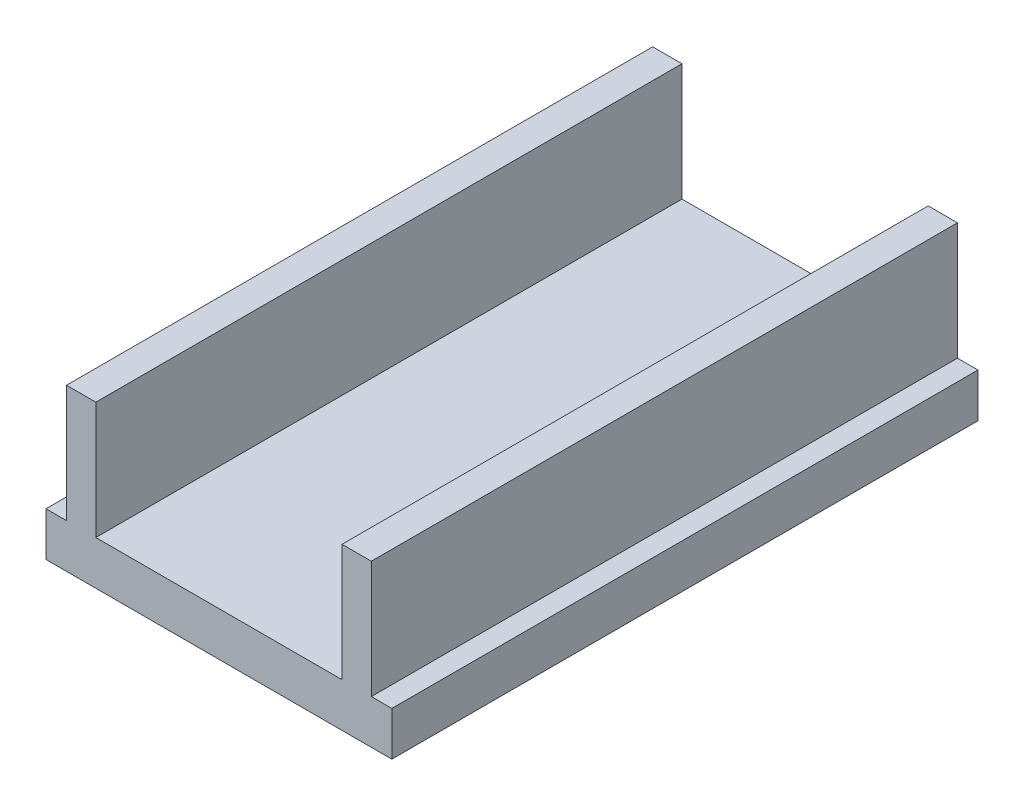
ISO-10303-21;
HEADER;
FILE_DESCRIPTION(('STEP AP214'),'2;1');
FILE_NAME('part.step','',(''),(''),'','','');
FILE_SCHEMA(('AUTOMOTIVE_DESIGN { 1 0 10303 214 1 1 1 1 }'));
ENDSEC;
DATA;
#1=APPLICATION_CONTEXT('core data for automotive mechanical design processes');
#2=APPLICATION_PROTOCOL_DEFINITION('international standard','automotive_design',2000,#1);
#3=PRODUCT_CONTEXT('',#1,'mechanical');
#4=PRODUCT('Part','Part','',(#3));
#5=PRODUCT_RELATED_PRODUCT_CATEGORY('part','',(#4));
#6=PRODUCT_DEFINITION_FORMATION('','',#4);
#7=PRODUCT_DEFINITION_CONTEXT('part definition',#1,'design');
#8=PRODUCT_DEFINITION('design','',#6,#7);
#9=PRODUCT_DEFINITION_SHAPE('','',#8);
#10=(LENGTH_UNIT() NAMED_UNIT(*) SI_UNIT(.MILLI.,.METRE.));
#11=(NAMED_UNIT(*) PLANE_ANGLE_UNIT() SI_UNIT($,.RADIAN.));
#12=(NAMED_UNIT(*) SI_UNIT($,.STERADIAN.) SOLID_ANGLE_UNIT());
#13=UNCERTAINTY_MEASURE_WITH_UNIT(LENGTH_MEASURE(1.E-05),#10,'distance_accuracy_value','');
#14=(GEOMETRIC_REPRESENTATION_CONTEXT(3) GLOBAL_UNCERTAINTY_ASSIGNED_CONTEXT((#13)) GLOBAL_UNIT_ASSIGNED_CONTEXT((#10,
#11,#12)) REPRESENTATION_CONTEXT('',''));
#15=CARTESIAN_POINT('',(0.,0.,0.));
#16=DIRECTION('',(0.,0.,1.));
#17=DIRECTION('',(1.,0.,0.));
#18=AXIS2_PLACEMENT_3D('',#15,#16,#17);
#19=CARTESIAN_POINT('',(0.,1.5,0.));
#20=DIRECTION('',(0.,1.,0.));
#21=DIRECTION('',(0.,0.,1.));
#22=AXIS2_PLACEMENT_3D('',#19,#20,#21);
#23=PLANE('',#22);
#24=DIRECTION('',(0.,0.,-1.));
#25=VECTOR('',#24,1.);
#26=CARTESIAN_POINT('',(3.81812080536913,1.5,0.));
#27=LINE('',#26,#25);
#28=CARTESIAN_POINT('',(3.81812080536913,1.5,7.15436241610738));
#29=VERTEX_POINT('',#28);
#30=CARTESIAN_POINT('',(3.81812080536913,1.5,-12.8456375838926));
#31=VERTEX_POINT('',#30);
#32=EDGE_CURVE('E163',#29,#31,#27,.T.);
#33=ORIENTED_EDGE('',*,*,#32,.T.);
#34=DIRECTION('',(1.,0.,0.));
#35=VECTOR('',#34,1.);
#36=CARTESIAN_POINT('',(0.,1.5,-12.8456375838926));
#37=LINE('',#36,#35);
#38=CARTESIAN_POINT('',(-4.58187919463087,1.5,-12.8456375838926));
#39=VERTEX_POINT('',#38);
#40=EDGE_CURVE('E150',#39,#31,#37,.T.);
#41=ORIENTED_EDGE('',*,*,#40,.F.);
#42=DIRECTION('',(0.,0.,-1.));
#43=VECTOR('',#42,1.);
#44=CARTESIAN_POINT('',(-4.58187919463087,1.5,0.));
#45=LINE('',#44,#43);
#46=CARTESIAN_POINT('',(-4.58187919463087,1.5,7.15436241610738));
#47=VERTEX_POINT('',#46);
#48=EDGE_CURVE('E184',#47,#39,#45,.T.);
#49=ORIENTED_EDGE('',*,*,#48,.F.);
#50=DIRECTION('',(1.,0.,0.));
#51=VECTOR('',#50,1.);
#52=CARTESIAN_POINT('',(0.,1.5,7.15436241610738));
#53=LINE('',#52,#51);
#54=EDGE_CURVE('E225',#47,#29,#53,.T.);
#55=ORIENTED_EDGE('',*,*,#54,.T.);
#56=EDGE_LOOP('',(#33,#41,#49,#55));
#57=FACE_BOUND('',#56,.T.);
#58=ADVANCED_FACE('F41',(#57),#23,.T.);
#59=CARTESIAN_POINT('',(-6.28187919463087,1.5,7.15436241610738));
#60=VERTEX_POINT('',#59);
#61=CARTESIAN_POINT('',(-5.58187919463087,1.5,7.15436241610738));
#62=VERTEX_POINT('',#61);
#63=EDGE_CURVE('E221',#60,#62,#53,.T.);
#64=ORIENTED_EDGE('',*,*,#63,.T.);
#65=DIRECTION('',(0.,0.,-1.));
#66=VECTOR('',#65,1.);
#67=CARTESIAN_POINT('',(-5.58187919463087,1.5,0.));
#68=LINE('',#67,#66);
#69=CARTESIAN_POINT('',(-5.58187919463087,1.5,-12.8456375838926));
#70=VERTEX_POINT('',#69);
#71=EDGE_CURVE('E65',#62,#70,#68,.T.);
#72=ORIENTED_EDGE('',*,*,#71,.T.);
#73=CARTESIAN_POINT('',(-6.28187919463087,1.5,-12.8456375838926));
#74=VERTEX_POINT('',#73);
#75=EDGE_CURVE('E230',#74,#70,#37,.T.);
#76=ORIENTED_EDGE('',*,*,#75,.F.);
#77=DIRECTION('',(0.,0.,1.));
#78=VECTOR('',#77,1.);
#79=CARTESIAN_POINT('',(-6.28187919463087,1.5,0.));
#80=LINE('',#79,#78);
#81=EDGE_CURVE('E215',#74,#60,#80,.T.);
#82=ORIENTED_EDGE('',*,*,#81,.T.);
#83=EDGE_LOOP('',(#64,#72,#76,#82));
#84=FACE_BOUND('',#83,.T.);
#85=ADVANCED_FACE('F287',(#84),#23,.T.);
#86=CARTESIAN_POINT('',(-6.28187919463087,1.5,0.));
#87=DIRECTION('',(1.,0.,0.));
#88=DIRECTION('',(0.,0.,-1.));
#89=AXIS2_PLACEMENT_3D('',#86,#87,#88);
#90=PLANE('',#89);
#91=DIRECTION('',(0.,0.,1.));
#92=VECTOR('',#91,1.);
#93=CARTESIAN_POINT('',(-6.28187919463087,0.,0.));
#94=LINE('',#93,#92);
#95=CARTESIAN_POINT('',(-6.28187919463087,0.,-12.8456375838926));
#96=VERTEX_POINT('',#95);
#97=CARTESIAN_POINT('',(-6.28187919463087,0.,7.15436241610738));
#98=VERTEX_POINT('',#97);
#99=EDGE_CURVE('E204',#96,#98,#94,.T.);
#100=ORIENTED_EDGE('',*,*,#99,.T.);
#101=DIRECTION('',(0.,-1.,0.));
#102=VECTOR('',#101,1.);
#103=CARTESIAN_POINT('',(-6.28187919463087,1.5,7.15436241610738));
#104=LINE('',#103,#102);
#105=EDGE_CURVE('E11',#60,#98,#104,.T.);
#106=ORIENTED_EDGE('',*,*,#105,.F.);
#107=ORIENTED_EDGE('',*,*,#81,.F.);
#108=DIRECTION('',(0.,-1.,0.));
#109=VECTOR('',#108,1.);
#110=CARTESIAN_POINT('',(-6.28187919463087,1.5,-12.8456375838926));
#111=LINE('',#110,#109);
#112=EDGE_CURVE('E233',#74,#96,#111,.T.);
#113=ORIENTED_EDGE('',*,*,#112,.T.);
#114=EDGE_LOOP('',(#100,#106,#107,#113));
#115=FACE_BOUND('',#114,.T.);
#116=ADVANCED_FACE('F43',(#115),#90,.F.);
#117=CARTESIAN_POINT('',(0.,1.5,7.15436241610738));
#118=DIRECTION('',(0.,0.,-1.));
#119=DIRECTION('',(-1.,0.,0.));
#120=AXIS2_PLACEMENT_3D('',#117,#118,#119);
#121=PLANE('',#120);
#122=DIRECTION('',(1.,0.,0.));
#123=VECTOR('',#122,1.);
#124=CARTESIAN_POINT('',(0.,0.,7.15436241610738));
#125=LINE('',#124,#123);
#126=CARTESIAN_POINT('',(5.51812080536913,0.,7.15436241610738));
#127=VERTEX_POINT('',#126);
#128=EDGE_CURVE('E237',#98,#127,#125,.T.);
#129=ORIENTED_EDGE('',*,*,#128,.T.);
#130=DIRECTION('',(0.,-1.,0.));
#131=VECTOR('',#130,1.);
#132=CARTESIAN_POINT('',(5.51812080536913,1.5,7.15436241610738));
#133=LINE('',#132,#131);
#134=CARTESIAN_POINT('',(5.51812080536913,1.5,7.15436241610738));
#135=VERTEX_POINT('',#134);
#136=EDGE_CURVE('E50',#135,#127,#133,.T.);
#137=ORIENTED_EDGE('',*,*,#136,.F.);
#138=CARTESIAN_POINT('',(4.81812080536913,1.5,7.15436241610738));
#139=VERTEX_POINT('',#138);
#140=EDGE_CURVE('E219',#139,#135,#53,.T.);
#141=ORIENTED_EDGE('',*,*,#140,.F.);
#142=DIRECTION('',(0.,-1.,0.));
#143=VECTOR('',#142,1.);
#144=CARTESIAN_POINT('',(4.81812080536913,5.5,7.15436241610738));
#145=LINE('',#144,#143);
#146=CARTESIAN_POINT('',(4.81812080536913,5.5,7.15436241610738));
#147=VERTEX_POINT('',#146);
#148=EDGE_CURVE('E174',#147,#139,#145,.T.);
#149=ORIENTED_EDGE('',*,*,#148,.F.);
#150=DIRECTION('',(-1.,0.,0.));
#151=VECTOR('',#150,1.);
#152=CARTESIAN_POINT('',(0.,5.5,7.15436241610738));
#153=LINE('',#152,#151);
#154=CARTESIAN_POINT('',(3.81812080536913,5.5,7.15436241610738));
#155=VERTEX_POINT('',#154);
#156=EDGE_CURVE('E156',#147,#155,#153,.T.);
#157=ORIENTED_EDGE('',*,*,#156,.T.);
#158=DIRECTION('',(0.,-1.,0.));
#159=VECTOR('',#158,1.);
#160=CARTESIAN_POINT('',(3.81812080536913,5.5,7.15436241610738));
#161=LINE('',#160,#159);
#162=EDGE_CURVE('E159',#155,#29,#161,.T.);
#163=ORIENTED_EDGE('',*,*,#162,.T.);
#164=ORIENTED_EDGE('',*,*,#54,.F.);
#165=DIRECTION('',(0.,-1.,0.));
#166=VECTOR('',#165,1.);
#167=CARTESIAN_POINT('',(-4.58187919463087,5.5,7.15436241610738));
#168=LINE('',#167,#166);
#169=CARTESIAN_POINT('',(-4.58187919463087,5.5,7.15436241610738));
#170=VERTEX_POINT('',#169);
#171=EDGE_CURVE('E200',#170,#47,#168,.T.);
#172=ORIENTED_EDGE('',*,*,#171,.F.);
#173=DIRECTION('',(-1.,0.,0.));
#174=VECTOR('',#173,1.);
#175=CARTESIAN_POINT('',(0.,5.5,7.15436241610738));
#176=LINE('',#175,#174);
#177=CARTESIAN_POINT('',(-5.58187919463087,5.5,7.15436241610738));
#178=VERTEX_POINT('',#177);
#179=EDGE_CURVE('E179',#170,#178,#176,.T.);
#180=ORIENTED_EDGE('',*,*,#179,.T.);
#181=DIRECTION('',(0.,-1.,0.));
#182=VECTOR('',#181,1.);
#183=CARTESIAN_POINT('',(-5.58187919463087,5.5,7.15436241610738));
#184=LINE('',#183,#182);
#185=EDGE_CURVE('E194',#178,#62,#184,.T.);
#186=ORIENTED_EDGE('',*,*,#185,.T.);
#187=ORIENTED_EDGE('',*,*,#63,.F.);
#188=ORIENTED_EDGE('',*,*,#105,.T.);
#189=EDGE_LOOP('',(#129,#137,#141,#149,#157,#163,#164,#172,#180,#186,#187,#188));
#190=FACE_BOUND('',#189,.T.);
#191=ADVANCED_FACE('F261',(#190),#121,.F.);
#192=CARTESIAN_POINT('',(5.51812080536913,1.5,0.));
#193=DIRECTION('',(1.,0.,0.));
#194=DIRECTION('',(0.,0.,-1.));
#195=AXIS2_PLACEMENT_3D('',#192,#193,#194);
#196=PLANE('',#195);
#197=DIRECTION('',(0.,0.,1.));
#198=VECTOR('',#197,1.);
#199=CARTESIAN_POINT('',(5.51812080536913,0.,0.));
#200=LINE('',#199,#198);
#201=CARTESIAN_POINT('',(5.51812080536913,0.,-12.8456375838926));
#202=VERTEX_POINT('',#201);
#203=EDGE_CURVE('E241',#202,#127,#200,.T.);
#204=ORIENTED_EDGE('',*,*,#203,.F.);
#205=DIRECTION('',(0.,-1.,0.));
#206=VECTOR('',#205,1.);
#207=CARTESIAN_POINT('',(5.51812080536913,1.5,-12.8456375838926));
#208=LINE('',#207,#206);
#209=CARTESIAN_POINT('',(5.51812080536913,1.5,-12.8456375838926));
#210=VERTEX_POINT('',#209);
#211=EDGE_CURVE('E250',#210,#202,#208,.T.);
#212=ORIENTED_EDGE('',*,*,#211,.F.);
#213=DIRECTION('',(0.,0.,1.));
#214=VECTOR('',#213,1.);
#215=CARTESIAN_POINT('',(5.51812080536913,1.5,0.));
#216=LINE('',#215,#214);
#217=EDGE_CURVE('E224',#210,#135,#216,.T.);
#218=ORIENTED_EDGE('',*,*,#217,.T.);
#219=ORIENTED_EDGE('',*,*,#136,.T.);
#220=EDGE_LOOP('',(#204,#212,#218,#219));
#221=FACE_BOUND('',#220,.T.);
#222=ADVANCED_FACE('F256',(#221),#196,.T.);
#223=CARTESIAN_POINT('',(0.,1.5,-12.8456375838926));
#224=DIRECTION('',(0.,0.,-1.));
#225=DIRECTION('',(-1.,0.,0.));
#226=AXIS2_PLACEMENT_3D('',#223,#224,#225);
#227=PLANE('',#226);
#228=DIRECTION('',(1.,0.,0.));
#229=VECTOR('',#228,1.);
#230=CARTESIAN_POINT('',(0.,0.,-12.8456375838926));
#231=LINE('',#230,#229);
#232=EDGE_CURVE('E220',#96,#202,#231,.T.);
#233=ORIENTED_EDGE('',*,*,#232,.F.);
#234=ORIENTED_EDGE('',*,*,#112,.F.);
#235=ORIENTED_EDGE('',*,*,#75,.T.);
#236=DIRECTION('',(0.,-1.,0.));
#237=VECTOR('',#236,1.);
#238=CARTESIAN_POINT('',(-5.58187919463087,5.5,-12.8456375838926));
#239=LINE('',#238,#237);
#240=CARTESIAN_POINT('',(-5.58187919463087,5.5,-12.8456375838926));
#241=VERTEX_POINT('',#240);
#242=EDGE_CURVE('E208',#241,#70,#239,.T.);
#243=ORIENTED_EDGE('',*,*,#242,.F.);
#244=DIRECTION('',(-1.,0.,0.));
#245=VECTOR('',#244,1.);
#246=CARTESIAN_POINT('',(0.,5.5,-12.8456375838926));
#247=LINE('',#246,#245);
#248=CARTESIAN_POINT('',(-4.58187919463087,5.5,-12.8456375838926));
#249=VERTEX_POINT('',#248);
#250=EDGE_CURVE('E188',#249,#241,#247,.T.);
#251=ORIENTED_EDGE('',*,*,#250,.F.);
#252=DIRECTION('',(0.,-1.,0.));
#253=VECTOR('',#252,1.);
#254=CARTESIAN_POINT('',(-4.58187919463087,5.5,-12.8456375838926));
#255=LINE('',#254,#253);
#256=EDGE_CURVE('E205',#249,#39,#255,.T.);
#257=ORIENTED_EDGE('',*,*,#256,.T.);
#258=ORIENTED_EDGE('',*,*,#40,.T.);
#259=DIRECTION('',(0.,-1.,0.));
#260=VECTOR('',#259,1.);
#261=CARTESIAN_POINT('',(3.81812080536913,5.5,-12.8456375838926));
#262=LINE('',#261,#260);
#263=CARTESIAN_POINT('',(3.81812080536913,5.5,-12.8456375838926));
#264=VERTEX_POINT('',#263);
#265=EDGE_CURVE('E146',#264,#31,#262,.T.);
#266=ORIENTED_EDGE('',*,*,#265,.F.);
#267=DIRECTION('',(-1.,0.,0.));
#268=VECTOR('',#267,1.);
#269=CARTESIAN_POINT('',(0.,5.5,-12.8456375838926));
#270=LINE('',#269,#268);
#271=CARTESIAN_POINT('',(4.81812080536913,5.5,-12.8456375838926));
#272=VERTEX_POINT('',#271);
#273=EDGE_CURVE('E133',#272,#264,#270,.T.);
#274=ORIENTED_EDGE('',*,*,#273,.F.);
#275=DIRECTION('',(0.,-1.,0.));
#276=VECTOR('',#275,1.);
#277=CARTESIAN_POINT('',(4.81812080536913,5.5,-12.8456375838926));
#278=LINE('',#277,#276);
#279=CARTESIAN_POINT('',(4.81812080536913,1.5,-12.8456375838926));
#280=VERTEX_POINT('',#279);
#281=EDGE_CURVE('E155',#272,#280,#278,.T.);
#282=ORIENTED_EDGE('',*,*,#281,.T.);
#283=EDGE_CURVE('E229',#280,#210,#37,.T.);
#284=ORIENTED_EDGE('',*,*,#283,.T.);
#285=ORIENTED_EDGE('',*,*,#211,.T.);
#286=EDGE_LOOP('',(#233,#234,#235,#243,#251,#257,#258,#266,#274,#282,#284,#285));
#287=FACE_BOUND('',#286,.T.);
#288=ADVANCED_FACE('F148',(#287),#227,.T.);
#289=DIRECTION('',(0.,0.,1.));
#290=VECTOR('',#289,1.);
#291=CARTESIAN_POINT('',(4.81812080536913,1.5,0.));
#292=LINE('',#291,#290);
#293=EDGE_CURVE('E57',#280,#139,#292,.T.);
#294=ORIENTED_EDGE('',*,*,#293,.T.);
#295=ORIENTED_EDGE('',*,*,#140,.T.);
#296=ORIENTED_EDGE('',*,*,#217,.F.);
#297=ORIENTED_EDGE('',*,*,#283,.F.);
#298=EDGE_LOOP('',(#294,#295,#296,#297));
#299=FACE_BOUND('',#298,.T.);
#300=ADVANCED_FACE('F269',(#299),#23,.T.);
#301=CARTESIAN_POINT('',(0.,0.,0.));
#302=DIRECTION('',(0.,1.,0.));
#303=DIRECTION('',(0.,0.,1.));
#304=AXIS2_PLACEMENT_3D('',#301,#302,#303);
#305=PLANE('',#304);
#306=ORIENTED_EDGE('',*,*,#99,.F.);
#307=ORIENTED_EDGE('',*,*,#232,.T.);
#308=ORIENTED_EDGE('',*,*,#203,.T.);
#309=ORIENTED_EDGE('',*,*,#128,.F.);
#310=EDGE_LOOP('',(#306,#307,#308,#309));
#311=FACE_BOUND('',#310,.T.);
#312=ADVANCED_FACE('F265',(#311),#305,.F.);
#313=CARTESIAN_POINT('',(-4.58187919463087,5.5,0.));
#314=DIRECTION('',(-1.,0.,0.));
#315=DIRECTION('',(0.,0.,1.));
#316=AXIS2_PLACEMENT_3D('',#313,#314,#315);
#317=PLANE('',#316);
#318=ORIENTED_EDGE('',*,*,#48,.T.);
#319=ORIENTED_EDGE('',*,*,#256,.F.);
#320=DIRECTION('',(0.,0.,-1.));
#321=VECTOR('',#320,1.);
#322=CARTESIAN_POINT('',(-4.58187919463087,5.5,0.));
#323=LINE('',#322,#321);
#324=EDGE_CURVE('E191',#170,#249,#323,.T.);
#325=ORIENTED_EDGE('',*,*,#324,.F.);
#326=ORIENTED_EDGE('',*,*,#171,.T.);
#327=EDGE_LOOP('',(#318,#319,#325,#326));
#328=FACE_BOUND('',#327,.T.);
#329=ADVANCED_FACE('F277',(#328),#317,.F.);
#330=CARTESIAN_POINT('',(-5.58187919463087,5.5,0.));
#331=DIRECTION('',(-1.,0.,0.));
#332=DIRECTION('',(0.,0.,1.));
#333=AXIS2_PLACEMENT_3D('',#330,#331,#332);
#334=PLANE('',#333);
#335=ORIENTED_EDGE('',*,*,#71,.F.);
#336=ORIENTED_EDGE('',*,*,#185,.F.);
#337=DIRECTION('',(0.,0.,-1.));
#338=VECTOR('',#337,1.);
#339=CARTESIAN_POINT('',(-5.58187919463087,5.5,0.));
#340=LINE('',#339,#338);
#341=EDGE_CURVE('E183',#178,#241,#340,.T.);
#342=ORIENTED_EDGE('',*,*,#341,.T.);
#343=ORIENTED_EDGE('',*,*,#242,.T.);
#344=EDGE_LOOP('',(#335,#336,#342,#343));
#345=FACE_BOUND('',#344,.T.);
#346=ADVANCED_FACE('F285',(#345),#334,.T.);
#347=CARTESIAN_POINT('',(0.,5.5,0.));
#348=DIRECTION('',(0.,-1.,0.));
#349=DIRECTION('',(0.,0.,-1.));
#350=AXIS2_PLACEMENT_3D('',#347,#348,#349);
#351=PLANE('',#350);
#352=ORIENTED_EDGE('',*,*,#179,.F.);
#353=ORIENTED_EDGE('',*,*,#324,.T.);
#354=ORIENTED_EDGE('',*,*,#250,.T.);
#355=ORIENTED_EDGE('',*,*,#341,.F.);
#356=EDGE_LOOP('',(#352,#353,#354,#355));
#357=FACE_BOUND('',#356,.T.);
#358=ADVANCED_FACE('F283',(#357),#351,.F.);
#359=CARTESIAN_POINT('',(3.81812080536913,5.5,0.));
#360=DIRECTION('',(-1.,0.,0.));
#361=DIRECTION('',(0.,0.,1.));
#362=AXIS2_PLACEMENT_3D('',#359,#360,#361);
#363=PLANE('',#362);
#364=ORIENTED_EDGE('',*,*,#32,.F.);
#365=ORIENTED_EDGE('',*,*,#162,.F.);
#366=DIRECTION('',(0.,0.,-1.));
#367=VECTOR('',#366,1.);
#368=CARTESIAN_POINT('',(3.81812080536913,5.5,0.));
#369=LINE('',#368,#367);
#370=EDGE_CURVE('E138',#155,#264,#369,.T.);
#371=ORIENTED_EDGE('',*,*,#370,.T.);
#372=ORIENTED_EDGE('',*,*,#265,.T.);
#373=EDGE_LOOP('',(#364,#365,#371,#372));
#374=FACE_BOUND('',#373,.T.);
#375=ADVANCED_FACE('F158',(#374),#363,.T.);
#376=CARTESIAN_POINT('',(4.81812080536913,5.5,0.));
#377=DIRECTION('',(1.,0.,0.));
#378=DIRECTION('',(0.,0.,-1.));
#379=AXIS2_PLACEMENT_3D('',#376,#377,#378);
#380=PLANE('',#379);
#381=ORIENTED_EDGE('',*,*,#293,.F.);
#382=ORIENTED_EDGE('',*,*,#281,.F.);
#383=DIRECTION('',(0.,0.,1.));
#384=VECTOR('',#383,1.);
#385=CARTESIAN_POINT('',(4.81812080536913,5.5,0.));
#386=LINE('',#385,#384);
#387=EDGE_CURVE('E141',#272,#147,#386,.T.);
#388=ORIENTED_EDGE('',*,*,#387,.T.);
#389=ORIENTED_EDGE('',*,*,#148,.T.);
#390=EDGE_LOOP('',(#381,#382,#388,#389));
#391=FACE_BOUND('',#390,.T.);
#392=ADVANCED_FACE('F364',(#391),#380,.T.);
#393=CARTESIAN_POINT('',(0.,5.5,0.));
#394=DIRECTION('',(0.,1.,0.));
#395=DIRECTION('',(0.,0.,1.));
#396=AXIS2_PLACEMENT_3D('',#393,#394,#395);
#397=PLANE('',#396);
#398=ORIENTED_EDGE('',*,*,#370,.F.);
#399=ORIENTED_EDGE('',*,*,#156,.F.);
#400=ORIENTED_EDGE('',*,*,#387,.F.);
#401=ORIENTED_EDGE('',*,*,#273,.T.);
#402=EDGE_LOOP('',(#398,#399,#400,#401));
#403=FACE_BOUND('',#402,.T.);
#404=ADVANCED_FACE('F135',(#403),#397,.T.);
#405=CLOSED_SHELL('',(#58,#85,#116,#191,#222,#288,#300,#312,#329,#346,#358,#375,#392,#404));
#406=MANIFOLD_SOLID_BREP('B2',#405);
#407=ADVANCED_BREP_SHAPE_REPRESENTATION('',(#18,#406),#14);
#408=SHAPE_DEFINITION_REPRESENTATION(#9,#407);
ENDSEC;
END-ISO-10303-21;
